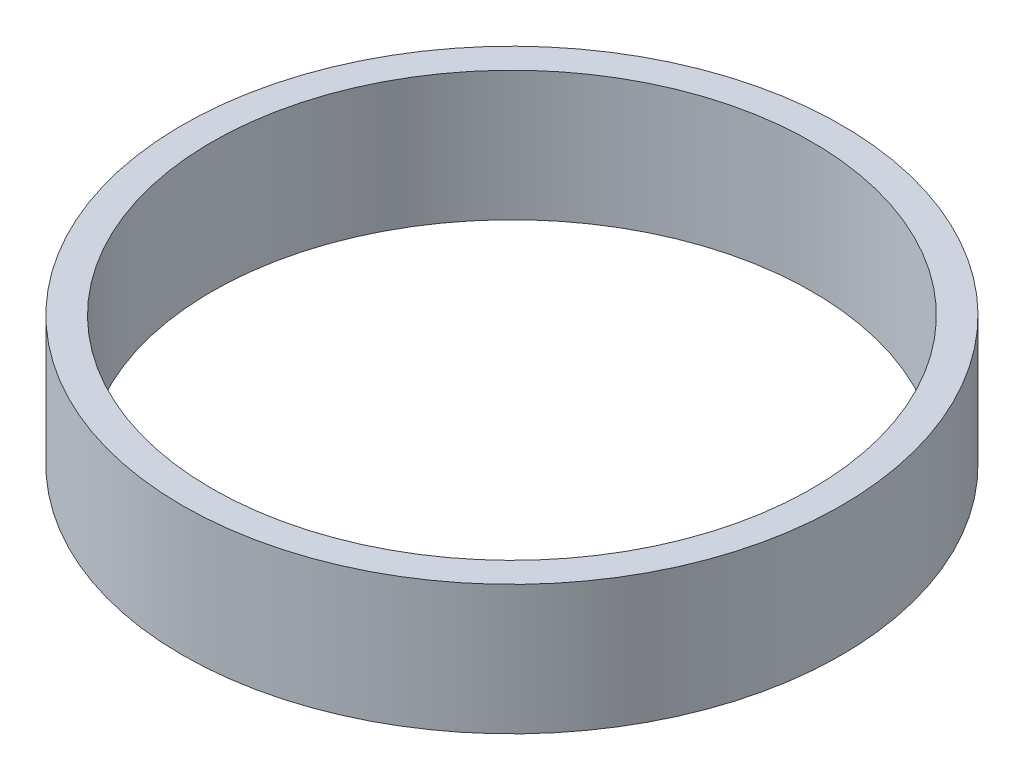
ISO-10303-21;
HEADER;
FILE_DESCRIPTION(('STEP AP214'),'2;1');
FILE_NAME('part.step','',(''),(''),'','','');
FILE_SCHEMA(('AUTOMOTIVE_DESIGN { 1 0 10303 214 1 1 1 1 }'));
ENDSEC;
DATA;
#1=APPLICATION_CONTEXT('core data for automotive mechanical design processes');
#2=APPLICATION_PROTOCOL_DEFINITION('international standard','automotive_design',2000,#1);
#3=PRODUCT_CONTEXT('',#1,'mechanical');
#4=PRODUCT('Part','Part','',(#3));
#5=PRODUCT_RELATED_PRODUCT_CATEGORY('part','',(#4));
#6=PRODUCT_DEFINITION_FORMATION('','',#4);
#7=PRODUCT_DEFINITION_CONTEXT('part definition',#1,'design');
#8=PRODUCT_DEFINITION('design','',#6,#7);
#9=PRODUCT_DEFINITION_SHAPE('','',#8);
#10=(LENGTH_UNIT() NAMED_UNIT(*) SI_UNIT(.MILLI.,.METRE.));
#11=(NAMED_UNIT(*) PLANE_ANGLE_UNIT() SI_UNIT($,.RADIAN.));
#12=(NAMED_UNIT(*) SI_UNIT($,.STERADIAN.) SOLID_ANGLE_UNIT());
#13=UNCERTAINTY_MEASURE_WITH_UNIT(LENGTH_MEASURE(1.E-05),#10,'distance_accuracy_value','');
#14=(GEOMETRIC_REPRESENTATION_CONTEXT(3) GLOBAL_UNCERTAINTY_ASSIGNED_CONTEXT((#13)) GLOBAL_UNIT_ASSIGNED_CONTEXT((#10,
#11,#12)) REPRESENTATION_CONTEXT('',''));
#15=CARTESIAN_POINT('',(0.,0.,0.));
#16=DIRECTION('',(0.,0.,1.));
#17=DIRECTION('',(1.,0.,0.));
#18=AXIS2_PLACEMENT_3D('',#15,#16,#17);
#19=CARTESIAN_POINT('',(0.,11.,0.));
#20=DIRECTION('',(0.,1.,0.));
#21=DIRECTION('',(0.,0.,1.));
#22=AXIS2_PLACEMENT_3D('',#19,#20,#21);
#23=PLANE('',#22);
#24=CARTESIAN_POINT('',(0.,11.,0.));
#25=DIRECTION('',(0.,1.,0.));
#26=DIRECTION('',(0.,0.,1.));
#27=AXIS2_PLACEMENT_3D('',#24,#25,#26);
#28=CIRCLE('',#27,28.);
#29=CARTESIAN_POINT('',(0.,11.,28.));
#30=VERTEX_POINT('',#29);
#31=EDGE_CURVE('E10',#30,#30,#28,.T.);
#32=ORIENTED_EDGE('',*,*,#31,.T.);
#33=EDGE_LOOP('',(#32));
#34=FACE_BOUND('',#33,.T.);
#35=CARTESIAN_POINT('',(0.,11.,0.));
#36=DIRECTION('',(0.,1.,0.));
#37=DIRECTION('',(0.,0.,1.));
#38=AXIS2_PLACEMENT_3D('',#35,#36,#37);
#39=CIRCLE('',#38,25.5);
#40=CARTESIAN_POINT('',(0.,11.,25.5));
#41=VERTEX_POINT('',#40);
#42=EDGE_CURVE('E53',#41,#41,#39,.T.);
#43=ORIENTED_EDGE('',*,*,#42,.F.);
#44=EDGE_LOOP('',(#43));
#45=FACE_BOUND('',#44,.T.);
#46=ADVANCED_FACE('F39',(#34,#45),#23,.T.);
#47=CARTESIAN_POINT('',(0.,0.,0.));
#48=DIRECTION('',(0.,1.,0.));
#49=DIRECTION('',(0.,0.,1.));
#50=AXIS2_PLACEMENT_3D('',#47,#48,#49);
#51=PLANE('',#50);
#52=CARTESIAN_POINT('',(0.,0.,0.));
#53=DIRECTION('',(0.,1.,0.));
#54=DIRECTION('',(0.,0.,1.));
#55=AXIS2_PLACEMENT_3D('',#52,#53,#54);
#56=CIRCLE('',#55,28.);
#57=CARTESIAN_POINT('',(0.,0.,28.));
#58=VERTEX_POINT('',#57);
#59=EDGE_CURVE('E43',#58,#58,#56,.T.);
#60=ORIENTED_EDGE('',*,*,#59,.F.);
#61=EDGE_LOOP('',(#60));
#62=FACE_BOUND('',#61,.T.);
#63=CARTESIAN_POINT('',(0.,0.,0.));
#64=DIRECTION('',(0.,1.,0.));
#65=DIRECTION('',(0.,0.,1.));
#66=AXIS2_PLACEMENT_3D('',#63,#64,#65);
#67=CIRCLE('',#66,25.5);
#68=CARTESIAN_POINT('',(0.,0.,25.5));
#69=VERTEX_POINT('',#68);
#70=EDGE_CURVE('E55',#69,#69,#67,.T.);
#71=ORIENTED_EDGE('',*,*,#70,.T.);
#72=EDGE_LOOP('',(#71));
#73=FACE_BOUND('',#72,.T.);
#74=ADVANCED_FACE('F66',(#62,#73),#51,.F.);
#75=CARTESIAN_POINT('',(0.,11.,0.));
#76=DIRECTION('',(0.,-1.,0.));
#77=DIRECTION('',(0.,0.,-1.));
#78=AXIS2_PLACEMENT_3D('',#75,#76,#77);
#79=CYLINDRICAL_SURFACE('',#78,28.);
#80=ORIENTED_EDGE('',*,*,#31,.F.);
#81=EDGE_LOOP('',(#80));
#82=FACE_BOUND('',#81,.T.);
#83=ORIENTED_EDGE('',*,*,#59,.T.);
#84=EDGE_LOOP('',(#83));
#85=FACE_BOUND('',#84,.T.);
#86=ADVANCED_FACE('F41',(#82,#85),#79,.T.);
#87=CARTESIAN_POINT('',(0.,11.,0.));
#88=DIRECTION('',(0.,-1.,0.));
#89=DIRECTION('',(0.,0.,-1.));
#90=AXIS2_PLACEMENT_3D('',#87,#88,#89);
#91=CYLINDRICAL_SURFACE('',#90,25.5);
#92=ORIENTED_EDGE('',*,*,#42,.T.);
#93=EDGE_LOOP('',(#92));
#94=FACE_BOUND('',#93,.T.);
#95=ORIENTED_EDGE('',*,*,#70,.F.);
#96=EDGE_LOOP('',(#95));
#97=FACE_BOUND('',#96,.T.);
#98=ADVANCED_FACE('F62',(#94,#97),#91,.F.);
#99=CLOSED_SHELL('',(#46,#74,#86,#98));
#100=MANIFOLD_SOLID_BREP('B2',#99);
#101=ADVANCED_BREP_SHAPE_REPRESENTATION('',(#18,#100),#14);
#102=SHAPE_DEFINITION_REPRESENTATION(#9,#101);
ENDSEC;
END-ISO-10303-21;
